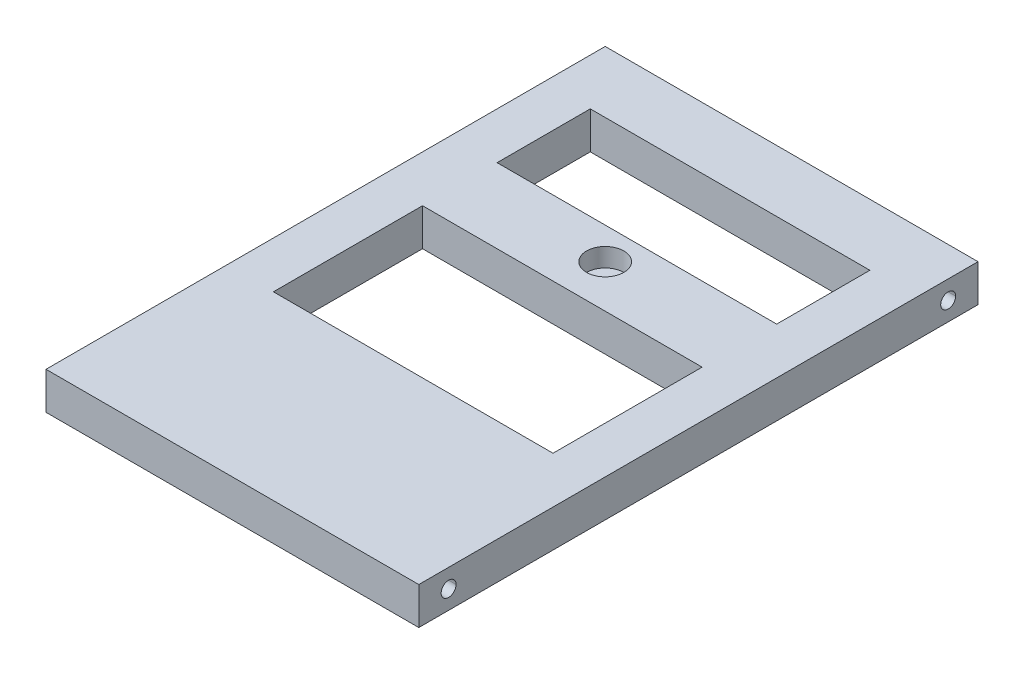
ISO-10303-21;
HEADER;
FILE_DESCRIPTION(('STEP AP214'),'2;1');
FILE_NAME('part.step','',(''),(''),'','','');
FILE_SCHEMA(('AUTOMOTIVE_DESIGN { 1 0 10303 214 1 1 1 1 }'));
ENDSEC;
DATA;
#1=APPLICATION_CONTEXT('core data for automotive mechanical design processes');
#2=APPLICATION_PROTOCOL_DEFINITION('international standard','automotive_design',2000,#1);
#3=PRODUCT_CONTEXT('',#1,'mechanical');
#4=PRODUCT('Part','Part','',(#3));
#5=PRODUCT_RELATED_PRODUCT_CATEGORY('part','',(#4));
#6=PRODUCT_DEFINITION_FORMATION('','',#4);
#7=PRODUCT_DEFINITION_CONTEXT('part definition',#1,'design');
#8=PRODUCT_DEFINITION('design','',#6,#7);
#9=PRODUCT_DEFINITION_SHAPE('','',#8);
#10=(LENGTH_UNIT() NAMED_UNIT(*) SI_UNIT(.MILLI.,.METRE.));
#11=(NAMED_UNIT(*) PLANE_ANGLE_UNIT() SI_UNIT($,.RADIAN.));
#12=(NAMED_UNIT(*) SI_UNIT($,.STERADIAN.) SOLID_ANGLE_UNIT());
#13=UNCERTAINTY_MEASURE_WITH_UNIT(LENGTH_MEASURE(1.E-05),#10,'distance_accuracy_value','');
#14=(GEOMETRIC_REPRESENTATION_CONTEXT(3) GLOBAL_UNCERTAINTY_ASSIGNED_CONTEXT((#13)) GLOBAL_UNIT_ASSIGNED_CONTEXT((#10,
#11,#12)) REPRESENTATION_CONTEXT('',''));
#15=CARTESIAN_POINT('',(0.,0.,0.));
#16=DIRECTION('',(0.,0.,1.));
#17=DIRECTION('',(1.,0.,0.));
#18=AXIS2_PLACEMENT_3D('',#15,#16,#17);
#19=CARTESIAN_POINT('',(100.,5.,-142.));
#20=DIRECTION('',(-1.,0.,0.));
#21=DIRECTION('',(0.,0.,1.));
#22=AXIS2_PLACEMENT_3D('',#19,#20,#21);
#23=CYLINDRICAL_SURFACE('',#22,2.);
#24=DIRECTION('',(-1.,0.,0.));
#25=VECTOR('',#24,1.);
#26=CARTESIAN_POINT('',(100.,5.,-144.));
#27=LINE('',#26,#25);
#28=CARTESIAN_POINT('',(0.,5.,-144.));
#29=VERTEX_POINT('',#28);
#30=CARTESIAN_POINT('',(100.,5.,-144.));
#31=VERTEX_POINT('',#30);
#32=EDGE_CURVE('E12',#29,#31,#27,.F.);
#33=ORIENTED_EDGE('',*,*,#32,.F.);
#34=CARTESIAN_POINT('',(0.,5.,-142.));
#35=DIRECTION('',(-1.,0.,0.));
#36=DIRECTION('',(0.,0.,1.));
#37=AXIS2_PLACEMENT_3D('',#34,#35,#36);
#38=CIRCLE('',#37,2.);
#39=CARTESIAN_POINT('',(0.,5.,-140.));
#40=VERTEX_POINT('',#39);
#41=EDGE_CURVE('E211',#29,#40,#38,.T.);
#42=ORIENTED_EDGE('',*,*,#41,.T.);
#43=DIRECTION('',(-1.,0.,0.));
#44=VECTOR('',#43,1.);
#45=CARTESIAN_POINT('',(100.,5.,-140.));
#46=LINE('',#45,#44);
#47=CARTESIAN_POINT('',(100.,5.,-140.));
#48=VERTEX_POINT('',#47);
#49=EDGE_CURVE('E57',#48,#40,#46,.T.);
#50=ORIENTED_EDGE('',*,*,#49,.F.);
#51=CARTESIAN_POINT('',(100.,5.,-142.));
#52=DIRECTION('',(-1.,0.,0.));
#53=DIRECTION('',(0.,0.,1.));
#54=AXIS2_PLACEMENT_3D('',#51,#52,#53);
#55=CIRCLE('',#54,2.);
#56=EDGE_CURVE('E265',#31,#48,#55,.T.);
#57=ORIENTED_EDGE('',*,*,#56,.F.);
#58=EDGE_LOOP('',(#33,#42,#50,#57));
#59=FACE_BOUND('',#58,.T.);
#60=ADVANCED_FACE('F48',(#59),#23,.F.);
#61=CARTESIAN_POINT('',(100.,5.,-8.00000000000001));
#62=DIRECTION('',(-1.,0.,0.));
#63=DIRECTION('',(0.,0.,1.));
#64=AXIS2_PLACEMENT_3D('',#61,#62,#63);
#65=CYLINDRICAL_SURFACE('',#64,2.);
#66=DIRECTION('',(-1.,0.,0.));
#67=VECTOR('',#66,1.);
#68=CARTESIAN_POINT('',(100.,5.,-10.));
#69=LINE('',#68,#67);
#70=CARTESIAN_POINT('',(0.,5.,-10.));
#71=VERTEX_POINT('',#70);
#72=CARTESIAN_POINT('',(100.,5.,-10.));
#73=VERTEX_POINT('',#72);
#74=EDGE_CURVE('E320',#71,#73,#69,.F.);
#75=ORIENTED_EDGE('',*,*,#74,.F.);
#76=CARTESIAN_POINT('',(0.,5.,-8.00000000000001));
#77=DIRECTION('',(-1.,0.,0.));
#78=DIRECTION('',(0.,0.,1.));
#79=AXIS2_PLACEMENT_3D('',#76,#77,#78);
#80=CIRCLE('',#79,2.);
#81=CARTESIAN_POINT('',(0.,5.,-6.00000000000001));
#82=VERTEX_POINT('',#81);
#83=EDGE_CURVE('E264',#71,#82,#80,.T.);
#84=ORIENTED_EDGE('',*,*,#83,.T.);
#85=DIRECTION('',(-1.,0.,0.));
#86=VECTOR('',#85,1.);
#87=CARTESIAN_POINT('',(100.,5.,-6.00000000000001));
#88=LINE('',#87,#86);
#89=CARTESIAN_POINT('',(100.,5.,-6.00000000000001));
#90=VERTEX_POINT('',#89);
#91=EDGE_CURVE('E317',#90,#82,#88,.T.);
#92=ORIENTED_EDGE('',*,*,#91,.F.);
#93=CARTESIAN_POINT('',(100.,5.,-8.00000000000001));
#94=DIRECTION('',(-1.,0.,0.));
#95=DIRECTION('',(0.,0.,1.));
#96=AXIS2_PLACEMENT_3D('',#93,#94,#95);
#97=CIRCLE('',#96,2.);
#98=EDGE_CURVE('E275',#73,#90,#97,.T.);
#99=ORIENTED_EDGE('',*,*,#98,.F.);
#100=EDGE_LOOP('',(#75,#84,#92,#99));
#101=FACE_BOUND('',#100,.T.);
#102=ADVANCED_FACE('F397',(#101),#65,.F.);
#103=CARTESIAN_POINT('',(100.,10.,0.));
#104=DIRECTION('',(0.,0.,-1.));
#105=DIRECTION('',(-1.,0.,0.));
#106=AXIS2_PLACEMENT_3D('',#103,#104,#105);
#107=PLANE('',#106);
#108=DIRECTION('',(1.,0.,0.));
#109=VECTOR('',#108,1.);
#110=CARTESIAN_POINT('',(100.,0.,0.));
#111=LINE('',#110,#109);
#112=CARTESIAN_POINT('',(0.,0.,0.));
#113=VERTEX_POINT('',#112);
#114=CARTESIAN_POINT('',(100.,0.,0.));
#115=VERTEX_POINT('',#114);
#116=EDGE_CURVE('E282',#113,#115,#111,.T.);
#117=ORIENTED_EDGE('',*,*,#116,.T.);
#118=DIRECTION('',(0.,-1.,0.));
#119=VECTOR('',#118,1.);
#120=CARTESIAN_POINT('',(100.,10.,0.));
#121=LINE('',#120,#119);
#122=CARTESIAN_POINT('',(100.,10.,0.));
#123=VERTEX_POINT('',#122);
#124=EDGE_CURVE('E312',#123,#115,#121,.T.);
#125=ORIENTED_EDGE('',*,*,#124,.F.);
#126=DIRECTION('',(1.,0.,0.));
#127=VECTOR('',#126,1.);
#128=CARTESIAN_POINT('',(100.,10.,0.));
#129=LINE('',#128,#127);
#130=CARTESIAN_POINT('',(0.,10.,0.));
#131=VERTEX_POINT('',#130);
#132=EDGE_CURVE('E300',#131,#123,#129,.T.);
#133=ORIENTED_EDGE('',*,*,#132,.F.);
#134=DIRECTION('',(0.,-1.,0.));
#135=VECTOR('',#134,1.);
#136=CARTESIAN_POINT('',(0.,10.,0.));
#137=LINE('',#136,#135);
#138=EDGE_CURVE('E301',#131,#113,#137,.T.);
#139=ORIENTED_EDGE('',*,*,#138,.T.);
#140=EDGE_LOOP('',(#117,#125,#133,#139));
#141=FACE_BOUND('',#140,.T.);
#142=ADVANCED_FACE('F50',(#141),#107,.F.);
#143=CARTESIAN_POINT('',(100.,10.,-150.));
#144=DIRECTION('',(-1.,0.,0.));
#145=DIRECTION('',(0.,0.,1.));
#146=AXIS2_PLACEMENT_3D('',#143,#144,#145);
#147=PLANE('',#146);
#148=EDGE_CURVE('E259',#48,#31,#55,.T.);
#149=ORIENTED_EDGE('',*,*,#148,.T.);
#150=ORIENTED_EDGE('',*,*,#56,.T.);
#151=EDGE_LOOP('',(#149,#150));
#152=FACE_BOUND('',#151,.T.);
#153=EDGE_CURVE('E269',#90,#73,#97,.T.);
#154=ORIENTED_EDGE('',*,*,#153,.T.);
#155=ORIENTED_EDGE('',*,*,#98,.T.);
#156=EDGE_LOOP('',(#154,#155));
#157=FACE_BOUND('',#156,.T.);
#158=DIRECTION('',(0.,0.,-1.));
#159=VECTOR('',#158,1.);
#160=CARTESIAN_POINT('',(100.,0.,-150.));
#161=LINE('',#160,#159);
#162=CARTESIAN_POINT('',(100.,0.,-150.));
#163=VERTEX_POINT('',#162);
#164=EDGE_CURVE('E288',#115,#163,#161,.T.);
#165=ORIENTED_EDGE('',*,*,#164,.T.);
#166=DIRECTION('',(0.,-1.,0.));
#167=VECTOR('',#166,1.);
#168=CARTESIAN_POINT('',(100.,10.,-150.));
#169=LINE('',#168,#167);
#170=CARTESIAN_POINT('',(100.,10.,-150.));
#171=VERTEX_POINT('',#170);
#172=EDGE_CURVE('E309',#171,#163,#169,.T.);
#173=ORIENTED_EDGE('',*,*,#172,.F.);
#174=DIRECTION('',(0.,0.,-1.));
#175=VECTOR('',#174,1.);
#176=CARTESIAN_POINT('',(100.,10.,-150.));
#177=LINE('',#176,#175);
#178=EDGE_CURVE('E337',#123,#171,#177,.T.);
#179=ORIENTED_EDGE('',*,*,#178,.F.);
#180=ORIENTED_EDGE('',*,*,#124,.T.);
#181=EDGE_LOOP('',(#165,#173,#179,#180));
#182=FACE_BOUND('',#181,.T.);
#183=ADVANCED_FACE('F362',(#152,#157,#182),#147,.F.);
#184=CARTESIAN_POINT('',(0.,10.,-150.));
#185=DIRECTION('',(0.,0.,1.));
#186=DIRECTION('',(1.,0.,0.));
#187=AXIS2_PLACEMENT_3D('',#184,#185,#186);
#188=PLANE('',#187);
#189=DIRECTION('',(-1.,0.,0.));
#190=VECTOR('',#189,1.);
#191=CARTESIAN_POINT('',(0.,0.,-150.));
#192=LINE('',#191,#190);
#193=CARTESIAN_POINT('',(0.,0.,-150.));
#194=VERTEX_POINT('',#193);
#195=EDGE_CURVE('E294',#163,#194,#192,.T.);
#196=ORIENTED_EDGE('',*,*,#195,.T.);
#197=DIRECTION('',(0.,-1.,0.));
#198=VECTOR('',#197,1.);
#199=CARTESIAN_POINT('',(0.,10.,-150.));
#200=LINE('',#199,#198);
#201=CARTESIAN_POINT('',(0.,10.,-150.));
#202=VERTEX_POINT('',#201);
#203=EDGE_CURVE('E305',#202,#194,#200,.T.);
#204=ORIENTED_EDGE('',*,*,#203,.F.);
#205=DIRECTION('',(-1.,0.,0.));
#206=VECTOR('',#205,1.);
#207=CARTESIAN_POINT('',(0.,10.,-150.));
#208=LINE('',#207,#206);
#209=EDGE_CURVE('E335',#171,#202,#208,.T.);
#210=ORIENTED_EDGE('',*,*,#209,.F.);
#211=ORIENTED_EDGE('',*,*,#172,.T.);
#212=EDGE_LOOP('',(#196,#204,#210,#211));
#213=FACE_BOUND('',#212,.T.);
#214=ADVANCED_FACE('F365',(#213),#188,.F.);
#215=CARTESIAN_POINT('',(0.,10.,0.));
#216=DIRECTION('',(1.,0.,0.));
#217=DIRECTION('',(0.,0.,-1.));
#218=AXIS2_PLACEMENT_3D('',#215,#216,#217);
#219=PLANE('',#218);
#220=EDGE_CURVE('E266',#40,#29,#38,.T.);
#221=ORIENTED_EDGE('',*,*,#220,.F.);
#222=ORIENTED_EDGE('',*,*,#41,.F.);
#223=EDGE_LOOP('',(#221,#222));
#224=FACE_BOUND('',#223,.T.);
#225=EDGE_CURVE('E276',#82,#71,#80,.T.);
#226=ORIENTED_EDGE('',*,*,#225,.F.);
#227=ORIENTED_EDGE('',*,*,#83,.F.);
#228=EDGE_LOOP('',(#226,#227));
#229=FACE_BOUND('',#228,.T.);
#230=DIRECTION('',(0.,0.,1.));
#231=VECTOR('',#230,1.);
#232=CARTESIAN_POINT('',(0.,0.,0.));
#233=LINE('',#232,#231);
#234=EDGE_CURVE('E297',#194,#113,#233,.T.);
#235=ORIENTED_EDGE('',*,*,#234,.T.);
#236=ORIENTED_EDGE('',*,*,#138,.F.);
#237=DIRECTION('',(0.,0.,1.));
#238=VECTOR('',#237,1.);
#239=CARTESIAN_POINT('',(0.,10.,0.));
#240=LINE('',#239,#238);
#241=EDGE_CURVE('E290',#202,#131,#240,.T.);
#242=ORIENTED_EDGE('',*,*,#241,.F.);
#243=ORIENTED_EDGE('',*,*,#203,.T.);
#244=EDGE_LOOP('',(#235,#236,#242,#243));
#245=FACE_BOUND('',#244,.T.);
#246=ADVANCED_FACE('F358',(#224,#229,#245),#219,.F.);
#247=CARTESIAN_POINT('',(0.,10.,0.));
#248=DIRECTION('',(0.,-1.,0.));
#249=DIRECTION('',(0.,0.,-1.));
#250=AXIS2_PLACEMENT_3D('',#247,#248,#249);
#251=PLANE('',#250);
#252=DIRECTION('',(-1.,0.,0.));
#253=VECTOR('',#252,1.);
#254=CARTESIAN_POINT('',(12.5,10.,-133.5));
#255=LINE('',#254,#253);
#256=CARTESIAN_POINT('',(87.5,10.,-133.5));
#257=VERTEX_POINT('',#256);
#258=CARTESIAN_POINT('',(12.5,10.,-133.5));
#259=VERTEX_POINT('',#258);
#260=EDGE_CURVE('E201',#257,#259,#255,.T.);
#261=ORIENTED_EDGE('',*,*,#260,.F.);
#262=DIRECTION('',(0.,0.,-1.));
#263=VECTOR('',#262,1.);
#264=CARTESIAN_POINT('',(87.5,10.,-133.5));
#265=LINE('',#264,#263);
#266=CARTESIAN_POINT('',(87.5,10.,-108.5));
#267=VERTEX_POINT('',#266);
#268=EDGE_CURVE('E167',#267,#257,#265,.T.);
#269=ORIENTED_EDGE('',*,*,#268,.F.);
#270=DIRECTION('',(1.,0.,0.));
#271=VECTOR('',#270,1.);
#272=CARTESIAN_POINT('',(12.5,10.,-108.5));
#273=LINE('',#272,#271);
#274=CARTESIAN_POINT('',(12.5,10.,-108.5));
#275=VERTEX_POINT('',#274);
#276=EDGE_CURVE('E188',#275,#267,#273,.T.);
#277=ORIENTED_EDGE('',*,*,#276,.F.);
#278=DIRECTION('',(0.,0.,1.));
#279=VECTOR('',#278,1.);
#280=CARTESIAN_POINT('',(12.5,10.,-133.5));
#281=LINE('',#280,#279);
#282=EDGE_CURVE('E192',#259,#275,#281,.T.);
#283=ORIENTED_EDGE('',*,*,#282,.F.);
#284=EDGE_LOOP('',(#261,#269,#277,#283));
#285=FACE_BOUND('',#284,.T.);
#286=DIRECTION('',(-1.,0.,0.));
#287=VECTOR('',#286,1.);
#288=CARTESIAN_POINT('',(12.5,10.,-88.5));
#289=LINE('',#288,#287);
#290=CARTESIAN_POINT('',(87.5,10.,-88.5));
#291=VERTEX_POINT('',#290);
#292=CARTESIAN_POINT('',(12.5,10.,-88.5));
#293=VERTEX_POINT('',#292);
#294=EDGE_CURVE('E238',#291,#293,#289,.T.);
#295=ORIENTED_EDGE('',*,*,#294,.F.);
#296=DIRECTION('',(0.,0.,-1.));
#297=VECTOR('',#296,1.);
#298=CARTESIAN_POINT('',(87.5,10.,-88.5));
#299=LINE('',#298,#297);
#300=CARTESIAN_POINT('',(87.5,10.,-48.5));
#301=VERTEX_POINT('',#300);
#302=EDGE_CURVE('E235',#301,#291,#299,.T.);
#303=ORIENTED_EDGE('',*,*,#302,.F.);
#304=DIRECTION('',(1.,0.,0.));
#305=VECTOR('',#304,1.);
#306=CARTESIAN_POINT('',(12.5,10.,-48.5));
#307=LINE('',#306,#305);
#308=CARTESIAN_POINT('',(12.5,10.,-48.5));
#309=VERTEX_POINT('',#308);
#310=EDGE_CURVE('E222',#309,#301,#307,.T.);
#311=ORIENTED_EDGE('',*,*,#310,.F.);
#312=DIRECTION('',(0.,0.,1.));
#313=VECTOR('',#312,1.);
#314=CARTESIAN_POINT('',(12.5,10.,-88.5));
#315=LINE('',#314,#313);
#316=EDGE_CURVE('E242',#293,#309,#315,.T.);
#317=ORIENTED_EDGE('',*,*,#316,.F.);
#318=EDGE_LOOP('',(#295,#303,#311,#317));
#319=FACE_BOUND('',#318,.T.);
#320=CARTESIAN_POINT('',(50.,10.,-100.));
#321=DIRECTION('',(0.,1.,0.));
#322=DIRECTION('',(0.,0.,1.));
#323=AXIS2_PLACEMENT_3D('',#320,#321,#322);
#324=CIRCLE('',#323,5.);
#325=CARTESIAN_POINT('',(50.,10.,-95.));
#326=VERTEX_POINT('',#325);
#327=EDGE_CURVE('E274',#326,#326,#324,.T.);
#328=ORIENTED_EDGE('',*,*,#327,.F.);
#329=EDGE_LOOP('',(#328));
#330=FACE_BOUND('',#329,.T.);
#331=ORIENTED_EDGE('',*,*,#132,.T.);
#332=ORIENTED_EDGE('',*,*,#178,.T.);
#333=ORIENTED_EDGE('',*,*,#209,.T.);
#334=ORIENTED_EDGE('',*,*,#241,.T.);
#335=EDGE_LOOP('',(#331,#332,#333,#334));
#336=FACE_BOUND('',#335,.T.);
#337=ADVANCED_FACE('F383',(#285,#319,#330,#336),#251,.F.);
#338=CARTESIAN_POINT('',(0.,0.,0.));
#339=DIRECTION('',(0.,-1.,0.));
#340=DIRECTION('',(0.,0.,-1.));
#341=AXIS2_PLACEMENT_3D('',#338,#339,#340);
#342=PLANE('',#341);
#343=DIRECTION('',(0.,0.,-1.));
#344=VECTOR('',#343,1.);
#345=CARTESIAN_POINT('',(87.5,0.,-133.5));
#346=LINE('',#345,#344);
#347=CARTESIAN_POINT('',(87.5,0.,-108.5));
#348=VERTEX_POINT('',#347);
#349=CARTESIAN_POINT('',(87.5,0.,-133.5));
#350=VERTEX_POINT('',#349);
#351=EDGE_CURVE('E164',#348,#350,#346,.T.);
#352=ORIENTED_EDGE('',*,*,#351,.T.);
#353=DIRECTION('',(-1.,0.,0.));
#354=VECTOR('',#353,1.);
#355=CARTESIAN_POINT('',(12.5,0.,-133.5));
#356=LINE('',#355,#354);
#357=CARTESIAN_POINT('',(12.5,0.,-133.5));
#358=VERTEX_POINT('',#357);
#359=EDGE_CURVE('E177',#350,#358,#356,.T.);
#360=ORIENTED_EDGE('',*,*,#359,.T.);
#361=DIRECTION('',(0.,0.,1.));
#362=VECTOR('',#361,1.);
#363=CARTESIAN_POINT('',(12.5,0.,-133.5));
#364=LINE('',#363,#362);
#365=CARTESIAN_POINT('',(12.5,0.,-108.5));
#366=VERTEX_POINT('',#365);
#367=EDGE_CURVE('E182',#358,#366,#364,.T.);
#368=ORIENTED_EDGE('',*,*,#367,.T.);
#369=DIRECTION('',(1.,0.,0.));
#370=VECTOR('',#369,1.);
#371=CARTESIAN_POINT('',(12.5,0.,-108.5));
#372=LINE('',#371,#370);
#373=EDGE_CURVE('E173',#366,#348,#372,.T.);
#374=ORIENTED_EDGE('',*,*,#373,.T.);
#375=EDGE_LOOP('',(#352,#360,#368,#374));
#376=FACE_BOUND('',#375,.T.);
#377=DIRECTION('',(0.,0.,-1.));
#378=VECTOR('',#377,1.);
#379=CARTESIAN_POINT('',(87.5,0.,-88.5));
#380=LINE('',#379,#378);
#381=CARTESIAN_POINT('',(87.5,0.,-48.5));
#382=VERTEX_POINT('',#381);
#383=CARTESIAN_POINT('',(87.5,0.,-88.5));
#384=VERTEX_POINT('',#383);
#385=EDGE_CURVE('E217',#382,#384,#380,.T.);
#386=ORIENTED_EDGE('',*,*,#385,.T.);
#387=DIRECTION('',(-1.,0.,0.));
#388=VECTOR('',#387,1.);
#389=CARTESIAN_POINT('',(12.5,0.,-88.5));
#390=LINE('',#389,#388);
#391=CARTESIAN_POINT('',(12.5,0.,-88.5));
#392=VERTEX_POINT('',#391);
#393=EDGE_CURVE('E221',#384,#392,#390,.T.);
#394=ORIENTED_EDGE('',*,*,#393,.T.);
#395=DIRECTION('',(0.,0.,1.));
#396=VECTOR('',#395,1.);
#397=CARTESIAN_POINT('',(12.5,0.,-88.5));
#398=LINE('',#397,#396);
#399=CARTESIAN_POINT('',(12.5,0.,-48.5));
#400=VERTEX_POINT('',#399);
#401=EDGE_CURVE('E226',#392,#400,#398,.T.);
#402=ORIENTED_EDGE('',*,*,#401,.T.);
#403=DIRECTION('',(1.,0.,0.));
#404=VECTOR('',#403,1.);
#405=CARTESIAN_POINT('',(12.5,0.,-48.5));
#406=LINE('',#405,#404);
#407=EDGE_CURVE('E230',#400,#382,#406,.T.);
#408=ORIENTED_EDGE('',*,*,#407,.T.);
#409=EDGE_LOOP('',(#386,#394,#402,#408));
#410=FACE_BOUND('',#409,.T.);
#411=ORIENTED_EDGE('',*,*,#116,.F.);
#412=ORIENTED_EDGE('',*,*,#234,.F.);
#413=ORIENTED_EDGE('',*,*,#195,.F.);
#414=ORIENTED_EDGE('',*,*,#164,.F.);
#415=EDGE_LOOP('',(#411,#412,#413,#414));
#416=FACE_BOUND('',#415,.T.);
#417=ADVANCED_FACE('F184',(#376,#410,#416),#342,.T.);
#418=CARTESIAN_POINT('',(50.,5.,-100.));
#419=DIRECTION('',(0.,1.,0.));
#420=DIRECTION('',(0.,0.,1.));
#421=AXIS2_PLACEMENT_3D('',#418,#419,#420);
#422=CYLINDRICAL_SURFACE('',#421,5.);
#423=CARTESIAN_POINT('',(50.,5.,-100.));
#424=DIRECTION('',(0.,1.,0.));
#425=DIRECTION('',(0.,0.,1.));
#426=AXIS2_PLACEMENT_3D('',#423,#424,#425);
#427=CIRCLE('',#426,5.);
#428=CARTESIAN_POINT('',(50.,5.,-95.));
#429=VERTEX_POINT('',#428);
#430=EDGE_CURVE('E289',#429,#429,#427,.T.);
#431=ORIENTED_EDGE('',*,*,#430,.F.);
#432=EDGE_LOOP('',(#431));
#433=FACE_BOUND('',#432,.T.);
#434=ORIENTED_EDGE('',*,*,#327,.T.);
#435=EDGE_LOOP('',(#434));
#436=FACE_BOUND('',#435,.T.);
#437=ADVANCED_FACE('F391',(#433,#436),#422,.F.);
#438=CARTESIAN_POINT('',(50.,5.,-100.));
#439=DIRECTION('',(0.,1.,0.));
#440=DIRECTION('',(0.,0.,1.));
#441=AXIS2_PLACEMENT_3D('',#438,#439,#440);
#442=PLANE('',#441);
#443=ORIENTED_EDGE('',*,*,#430,.T.);
#444=EDGE_LOOP('',(#443));
#445=FACE_BOUND('',#444,.T.);
#446=ADVANCED_FACE('F414',(#445),#442,.T.);
#447=ORIENTED_EDGE('',*,*,#225,.T.);
#448=ORIENTED_EDGE('',*,*,#74,.T.);
#449=ORIENTED_EDGE('',*,*,#153,.F.);
#450=ORIENTED_EDGE('',*,*,#91,.T.);
#451=EDGE_LOOP('',(#447,#448,#449,#450));
#452=FACE_BOUND('',#451,.T.);
#453=ADVANCED_FACE('F404',(#452),#65,.F.);
#454=ORIENTED_EDGE('',*,*,#220,.T.);
#455=ORIENTED_EDGE('',*,*,#32,.T.);
#456=ORIENTED_EDGE('',*,*,#148,.F.);
#457=ORIENTED_EDGE('',*,*,#49,.T.);
#458=EDGE_LOOP('',(#454,#455,#456,#457));
#459=FACE_BOUND('',#458,.T.);
#460=ADVANCED_FACE('F360',(#459),#23,.F.);
#461=CARTESIAN_POINT('',(87.5,0.,-88.5));
#462=DIRECTION('',(1.,0.,0.));
#463=DIRECTION('',(0.,0.,-1.));
#464=AXIS2_PLACEMENT_3D('',#461,#462,#463);
#465=PLANE('',#464);
#466=ORIENTED_EDGE('',*,*,#302,.T.);
#467=DIRECTION('',(0.,1.,0.));
#468=VECTOR('',#467,1.);
#469=CARTESIAN_POINT('',(87.5,0.,-88.5));
#470=LINE('',#469,#468);
#471=EDGE_CURVE('E234',#384,#291,#470,.T.);
#472=ORIENTED_EDGE('',*,*,#471,.F.);
#473=ORIENTED_EDGE('',*,*,#385,.F.);
#474=DIRECTION('',(0.,1.,0.));
#475=VECTOR('',#474,1.);
#476=CARTESIAN_POINT('',(87.5,0.,-48.5));
#477=LINE('',#476,#475);
#478=EDGE_CURVE('E202',#382,#301,#477,.T.);
#479=ORIENTED_EDGE('',*,*,#478,.T.);
#480=EDGE_LOOP('',(#466,#472,#473,#479));
#481=FACE_BOUND('',#480,.T.);
#482=ADVANCED_FACE('F407',(#481),#465,.F.);
#483=CARTESIAN_POINT('',(12.5,0.,-48.5));
#484=DIRECTION('',(0.,0.,1.));
#485=DIRECTION('',(1.,0.,0.));
#486=AXIS2_PLACEMENT_3D('',#483,#484,#485);
#487=PLANE('',#486);
#488=ORIENTED_EDGE('',*,*,#310,.T.);
#489=ORIENTED_EDGE('',*,*,#478,.F.);
#490=ORIENTED_EDGE('',*,*,#407,.F.);
#491=DIRECTION('',(0.,1.,0.));
#492=VECTOR('',#491,1.);
#493=CARTESIAN_POINT('',(12.5,0.,-48.5));
#494=LINE('',#493,#492);
#495=EDGE_CURVE('E251',#400,#309,#494,.T.);
#496=ORIENTED_EDGE('',*,*,#495,.T.);
#497=EDGE_LOOP('',(#488,#489,#490,#496));
#498=FACE_BOUND('',#497,.T.);
#499=ADVANCED_FACE('F412',(#498),#487,.F.);
#500=CARTESIAN_POINT('',(12.5,0.,-88.5));
#501=DIRECTION('',(-1.,0.,0.));
#502=DIRECTION('',(0.,0.,1.));
#503=AXIS2_PLACEMENT_3D('',#500,#501,#502);
#504=PLANE('',#503);
#505=ORIENTED_EDGE('',*,*,#316,.T.);
#506=ORIENTED_EDGE('',*,*,#495,.F.);
#507=ORIENTED_EDGE('',*,*,#401,.F.);
#508=DIRECTION('',(0.,1.,0.));
#509=VECTOR('',#508,1.);
#510=CARTESIAN_POINT('',(12.5,0.,-88.5));
#511=LINE('',#510,#509);
#512=EDGE_CURVE('E254',#392,#293,#511,.T.);
#513=ORIENTED_EDGE('',*,*,#512,.T.);
#514=EDGE_LOOP('',(#505,#506,#507,#513));
#515=FACE_BOUND('',#514,.T.);
#516=ADVANCED_FACE('F461',(#515),#504,.F.);
#517=CARTESIAN_POINT('',(12.5,0.,-88.5));
#518=DIRECTION('',(0.,0.,-1.));
#519=DIRECTION('',(-1.,0.,0.));
#520=AXIS2_PLACEMENT_3D('',#517,#518,#519);
#521=PLANE('',#520);
#522=ORIENTED_EDGE('',*,*,#294,.T.);
#523=ORIENTED_EDGE('',*,*,#512,.F.);
#524=ORIENTED_EDGE('',*,*,#393,.F.);
#525=ORIENTED_EDGE('',*,*,#471,.T.);
#526=EDGE_LOOP('',(#522,#523,#524,#525));
#527=FACE_BOUND('',#526,.T.);
#528=ADVANCED_FACE('F471',(#527),#521,.F.);
#529=CARTESIAN_POINT('',(87.5,0.,-133.5));
#530=DIRECTION('',(1.,0.,0.));
#531=DIRECTION('',(0.,0.,-1.));
#532=AXIS2_PLACEMENT_3D('',#529,#530,#531);
#533=PLANE('',#532);
#534=ORIENTED_EDGE('',*,*,#268,.T.);
#535=DIRECTION('',(0.,1.,0.));
#536=VECTOR('',#535,1.);
#537=CARTESIAN_POINT('',(87.5,0.,-133.5));
#538=LINE('',#537,#536);
#539=EDGE_CURVE('E160',#350,#257,#538,.T.);
#540=ORIENTED_EDGE('',*,*,#539,.F.);
#541=ORIENTED_EDGE('',*,*,#351,.F.);
#542=DIRECTION('',(0.,1.,0.));
#543=VECTOR('',#542,1.);
#544=CARTESIAN_POINT('',(87.5,0.,-108.5));
#545=LINE('',#544,#543);
#546=EDGE_CURVE('E208',#348,#267,#545,.T.);
#547=ORIENTED_EDGE('',*,*,#546,.T.);
#548=EDGE_LOOP('',(#534,#540,#541,#547));
#549=FACE_BOUND('',#548,.T.);
#550=ADVANCED_FACE('F162',(#549),#533,.F.);
#551=CARTESIAN_POINT('',(12.5,0.,-108.5));
#552=DIRECTION('',(0.,0.,1.));
#553=DIRECTION('',(1.,0.,0.));
#554=AXIS2_PLACEMENT_3D('',#551,#552,#553);
#555=PLANE('',#554);
#556=ORIENTED_EDGE('',*,*,#276,.T.);
#557=ORIENTED_EDGE('',*,*,#546,.F.);
#558=ORIENTED_EDGE('',*,*,#373,.F.);
#559=DIRECTION('',(0.,1.,0.));
#560=VECTOR('',#559,1.);
#561=CARTESIAN_POINT('',(12.5,0.,-108.5));
#562=LINE('',#561,#560);
#563=EDGE_CURVE('E212',#366,#275,#562,.T.);
#564=ORIENTED_EDGE('',*,*,#563,.T.);
#565=EDGE_LOOP('',(#556,#557,#558,#564));
#566=FACE_BOUND('',#565,.T.);
#567=ADVANCED_FACE('F490',(#566),#555,.F.);
#568=CARTESIAN_POINT('',(12.5,0.,-133.5));
#569=DIRECTION('',(-1.,0.,0.));
#570=DIRECTION('',(0.,0.,1.));
#571=AXIS2_PLACEMENT_3D('',#568,#569,#570);
#572=PLANE('',#571);
#573=ORIENTED_EDGE('',*,*,#282,.T.);
#574=ORIENTED_EDGE('',*,*,#563,.F.);
#575=ORIENTED_EDGE('',*,*,#367,.F.);
#576=DIRECTION('',(0.,1.,0.));
#577=VECTOR('',#576,1.);
#578=CARTESIAN_POINT('',(12.5,0.,-133.5));
#579=LINE('',#578,#577);
#580=EDGE_CURVE('E172',#358,#259,#579,.T.);
#581=ORIENTED_EDGE('',*,*,#580,.T.);
#582=EDGE_LOOP('',(#573,#574,#575,#581));
#583=FACE_BOUND('',#582,.T.);
#584=ADVANCED_FACE('F499',(#583),#572,.F.);
#585=CARTESIAN_POINT('',(12.5,0.,-133.5));
#586=DIRECTION('',(0.,0.,-1.));
#587=DIRECTION('',(-1.,0.,0.));
#588=AXIS2_PLACEMENT_3D('',#585,#586,#587);
#589=PLANE('',#588);
#590=ORIENTED_EDGE('',*,*,#260,.T.);
#591=ORIENTED_EDGE('',*,*,#580,.F.);
#592=ORIENTED_EDGE('',*,*,#359,.F.);
#593=ORIENTED_EDGE('',*,*,#539,.T.);
#594=EDGE_LOOP('',(#590,#591,#592,#593));
#595=FACE_BOUND('',#594,.T.);
#596=ADVANCED_FACE('F178',(#595),#589,.F.);
#597=CLOSED_SHELL('',(#60,#102,#142,#183,#214,#246,#337,#417,#437,#446,#453,#460,#482,#499,#516,
#528,#550,#567,#584,#596));
#598=MANIFOLD_SOLID_BREP('B2',#597);
#599=ADVANCED_BREP_SHAPE_REPRESENTATION('',(#18,#598),#14);
#600=SHAPE_DEFINITION_REPRESENTATION(#9,#599);
ENDSEC;
END-ISO-10303-21;
